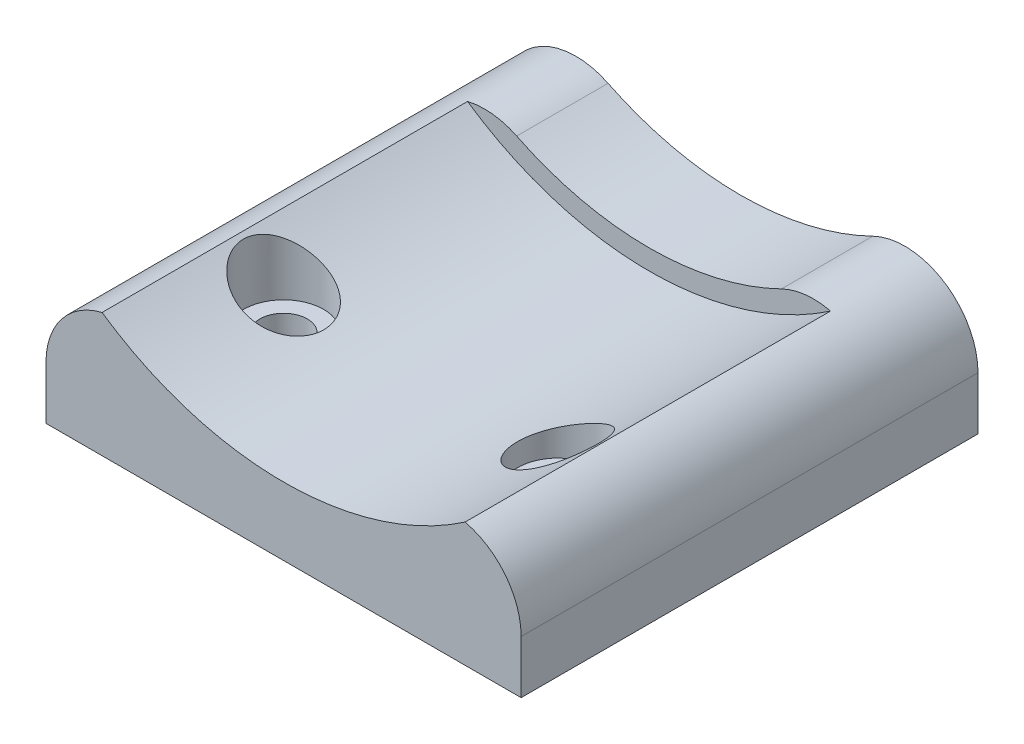
ISO-10303-21;
HEADER;
FILE_DESCRIPTION(('STEP AP214'),'2;1');
FILE_NAME('part.step','',(''),(''),'','','');
FILE_SCHEMA(('AUTOMOTIVE_DESIGN { 1 0 10303 214 1 1 1 1 }'));
ENDSEC;
DATA;
#1=APPLICATION_CONTEXT('core data for automotive mechanical design processes');
#2=APPLICATION_PROTOCOL_DEFINITION('international standard','automotive_design',2000,#1);
#3=PRODUCT_CONTEXT('',#1,'mechanical');
#4=PRODUCT('Part','Part','',(#3));
#5=PRODUCT_RELATED_PRODUCT_CATEGORY('part','',(#4));
#6=PRODUCT_DEFINITION_FORMATION('','',#4);
#7=PRODUCT_DEFINITION_CONTEXT('part definition',#1,'design');
#8=PRODUCT_DEFINITION('design','',#6,#7);
#9=PRODUCT_DEFINITION_SHAPE('','',#8);
#10=(LENGTH_UNIT() NAMED_UNIT(*) SI_UNIT(.MILLI.,.METRE.));
#11=(NAMED_UNIT(*) PLANE_ANGLE_UNIT() SI_UNIT($,.RADIAN.));
#12=(NAMED_UNIT(*) SI_UNIT($,.STERADIAN.) SOLID_ANGLE_UNIT());
#13=UNCERTAINTY_MEASURE_WITH_UNIT(LENGTH_MEASURE(1.E-05),#10,'distance_accuracy_value','');
#14=(GEOMETRIC_REPRESENTATION_CONTEXT(3) GLOBAL_UNCERTAINTY_ASSIGNED_CONTEXT((#13)) GLOBAL_UNIT_ASSIGNED_CONTEXT((#10,
#11,#12)) REPRESENTATION_CONTEXT('',''));
#15=CARTESIAN_POINT('',(0.,0.,0.));
#16=DIRECTION('',(0.,0.,1.));
#17=DIRECTION('',(1.,0.,0.));
#18=AXIS2_PLACEMENT_3D('',#15,#16,#17);
#19=CARTESIAN_POINT('',(0.,54.1496007592404,-63.5));
#20=DIRECTION('',(0.,0.,1.));
#21=DIRECTION('',(1.,0.,0.));
#22=AXIS2_PLACEMENT_3D('',#19,#20,#21);
#23=CYLINDRICAL_SURFACE('',#22,41.91);
#24=DIRECTION('',(0.,0.,1.));
#25=VECTOR('',#24,1.);
#26=CARTESIAN_POINT('',(-18.3995121951219,16.4945074652176,-63.5));
#27=LINE('',#26,#25);
#28=CARTESIAN_POINT('',(-18.3995121951219,16.4945074652176,-63.5));
#29=VERTEX_POINT('',#28);
#30=CARTESIAN_POINT('',(-18.3995121951219,16.4945074652176,-50.8));
#31=VERTEX_POINT('',#30);
#32=EDGE_CURVE('E114',#29,#31,#27,.T.);
#33=ORIENTED_EDGE('',*,*,#32,.T.);
#34=CARTESIAN_POINT('',(0.,54.1496007592404,-50.8));
#35=DIRECTION('',(0.,0.,1.));
#36=DIRECTION('',(1.,0.,0.));
#37=AXIS2_PLACEMENT_3D('',#34,#35,#36);
#38=CIRCLE('',#37,41.91);
#39=CARTESIAN_POINT('',(18.3995121951219,16.4945074652176,-50.8));
#40=VERTEX_POINT('',#39);
#41=EDGE_CURVE('E229',#31,#40,#38,.T.);
#42=ORIENTED_EDGE('',*,*,#41,.T.);
#43=DIRECTION('',(0.,0.,1.));
#44=VECTOR('',#43,1.);
#45=CARTESIAN_POINT('',(18.3995121951219,16.4945074652176,-63.5));
#46=LINE('',#45,#44);
#47=CARTESIAN_POINT('',(18.3995121951219,16.4945074652176,-63.5));
#48=VERTEX_POINT('',#47);
#49=EDGE_CURVE('E126',#48,#40,#46,.T.);
#50=ORIENTED_EDGE('',*,*,#49,.F.);
#51=CARTESIAN_POINT('',(0.,54.1496007592404,-63.5));
#52=DIRECTION('',(0.,0.,-1.));
#53=DIRECTION('',(1.,0.,0.));
#54=AXIS2_PLACEMENT_3D('',#51,#52,#53);
#55=CIRCLE('',#54,41.91);
#56=EDGE_CURVE('E132',#48,#29,#55,.T.);
#57=ORIENTED_EDGE('',*,*,#56,.T.);
#58=EDGE_LOOP('',(#33,#42,#50,#57));
#59=FACE_BOUND('',#58,.T.);
#60=ADVANCED_FACE('F43',(#59),#23,.F.);
#61=CARTESIAN_POINT('',(33.02,0.,-63.5));
#62=DIRECTION('',(0.,-1.,0.));
#63=DIRECTION('',(1.,0.,0.));
#64=AXIS2_PLACEMENT_3D('',#61,#62,#63);
#65=PLANE('',#64);
#66=CARTESIAN_POINT('',(-19.05,0.,-19.05));
#67=DIRECTION('',(0.,-1.,0.));
#68=DIRECTION('',(1.,0.,0.));
#69=AXIS2_PLACEMENT_3D('',#66,#67,#68);
#70=CIRCLE('',#69,3.30199999999999);
#71=CARTESIAN_POINT('',(-15.748,0.,-19.05));
#72=VERTEX_POINT('',#71);
#73=EDGE_CURVE('E238',#72,#72,#70,.T.);
#74=ORIENTED_EDGE('',*,*,#73,.F.);
#75=EDGE_LOOP('',(#74));
#76=FACE_BOUND('',#75,.T.);
#77=CARTESIAN_POINT('',(19.05,0.,-19.05));
#78=DIRECTION('',(0.,-1.,0.));
#79=DIRECTION('',(1.,0.,0.));
#80=AXIS2_PLACEMENT_3D('',#77,#78,#79);
#81=CIRCLE('',#80,3.302);
#82=CARTESIAN_POINT('',(22.352,0.,-19.05));
#83=VERTEX_POINT('',#82);
#84=EDGE_CURVE('E240',#83,#83,#81,.T.);
#85=ORIENTED_EDGE('',*,*,#84,.F.);
#86=EDGE_LOOP('',(#85));
#87=FACE_BOUND('',#86,.T.);
#88=DIRECTION('',(1.,0.,0.));
#89=VECTOR('',#88,1.);
#90=CARTESIAN_POINT('',(33.02,0.,0.));
#91=LINE('',#90,#89);
#92=CARTESIAN_POINT('',(-33.02,0.,0.));
#93=VERTEX_POINT('',#92);
#94=CARTESIAN_POINT('',(33.02,0.,0.));
#95=VERTEX_POINT('',#94);
#96=EDGE_CURVE('E144',#93,#95,#91,.T.);
#97=ORIENTED_EDGE('',*,*,#96,.F.);
#98=DIRECTION('',(0.,0.,1.));
#99=VECTOR('',#98,1.);
#100=CARTESIAN_POINT('',(-33.02,0.,-63.5));
#101=LINE('',#100,#99);
#102=CARTESIAN_POINT('',(-33.02,0.,-63.5));
#103=VERTEX_POINT('',#102);
#104=EDGE_CURVE('E57',#103,#93,#101,.T.);
#105=ORIENTED_EDGE('',*,*,#104,.F.);
#106=DIRECTION('',(1.,0.,0.));
#107=VECTOR('',#106,1.);
#108=CARTESIAN_POINT('',(33.02,0.,-63.5));
#109=LINE('',#108,#107);
#110=CARTESIAN_POINT('',(33.02,0.,-63.5));
#111=VERTEX_POINT('',#110);
#112=EDGE_CURVE('E158',#103,#111,#109,.T.);
#113=ORIENTED_EDGE('',*,*,#112,.T.);
#114=DIRECTION('',(0.,0.,1.));
#115=VECTOR('',#114,1.);
#116=CARTESIAN_POINT('',(33.02,0.,-63.5));
#117=LINE('',#116,#115);
#118=EDGE_CURVE('E100',#111,#95,#117,.T.);
#119=ORIENTED_EDGE('',*,*,#118,.T.);
#120=EDGE_LOOP('',(#97,#105,#113,#119));
#121=FACE_BOUND('',#120,.T.);
#122=ADVANCED_FACE('F45',(#76,#87,#121),#65,.T.);
#123=CARTESIAN_POINT('',(-33.02,0.,-63.5));
#124=DIRECTION('',(-1.,0.,0.));
#125=DIRECTION('',(0.,0.,1.));
#126=AXIS2_PLACEMENT_3D('',#123,#124,#125);
#127=PLANE('',#126);
#128=DIRECTION('',(0.,-1.,0.));
#129=VECTOR('',#128,1.);
#130=CARTESIAN_POINT('',(-33.02,0.,0.));
#131=LINE('',#130,#129);
#132=CARTESIAN_POINT('',(-33.02,7.366,0.));
#133=VERTEX_POINT('',#132);
#134=EDGE_CURVE('E155',#133,#93,#131,.T.);
#135=ORIENTED_EDGE('',*,*,#134,.F.);
#136=DIRECTION('',(0.,0.,1.));
#137=VECTOR('',#136,1.);
#138=CARTESIAN_POINT('',(-33.02,7.366,-63.5));
#139=LINE('',#138,#137);
#140=CARTESIAN_POINT('',(-33.02,7.366,-63.5));
#141=VERTEX_POINT('',#140);
#142=EDGE_CURVE('E125',#141,#133,#139,.T.);
#143=ORIENTED_EDGE('',*,*,#142,.F.);
#144=DIRECTION('',(0.,-1.,0.));
#145=VECTOR('',#144,1.);
#146=CARTESIAN_POINT('',(-33.02,0.,-63.5));
#147=LINE('',#146,#145);
#148=EDGE_CURVE('E134',#141,#103,#147,.T.);
#149=ORIENTED_EDGE('',*,*,#148,.T.);
#150=ORIENTED_EDGE('',*,*,#104,.T.);
#151=EDGE_LOOP('',(#135,#143,#149,#150));
#152=FACE_BOUND('',#151,.T.);
#153=ADVANCED_FACE('F211',(#152),#127,.T.);
#154=CARTESIAN_POINT('',(-22.86,7.366,-63.5));
#155=DIRECTION('',(0.,0.,1.));
#156=DIRECTION('',(1.,0.,0.));
#157=AXIS2_PLACEMENT_3D('',#154,#155,#156);
#158=CYLINDRICAL_SURFACE('',#157,10.16);
#159=DIRECTION('',(0.,0.,1.));
#160=VECTOR('',#159,1.);
#161=CARTESIAN_POINT('',(-25.2299659074032,17.2457197125094,-25.4));
#162=LINE('',#161,#160);
#163=CARTESIAN_POINT('',(-25.2299659074032,17.2457197125094,-50.8));
#164=VERTEX_POINT('',#163);
#165=CARTESIAN_POINT('',(-25.2299659074032,17.2457197125094,0.));
#166=VERTEX_POINT('',#165);
#167=EDGE_CURVE('E65',#164,#166,#162,.T.);
#168=ORIENTED_EDGE('',*,*,#167,.F.);
#169=CARTESIAN_POINT('',(-22.86,7.366,-50.8));
#170=DIRECTION('',(0.,0.,1.));
#171=DIRECTION('',(1.,0.,0.));
#172=AXIS2_PLACEMENT_3D('',#169,#170,#171);
#173=CIRCLE('',#172,10.16);
#174=EDGE_CURVE('E121',#164,#31,#173,.F.);
#175=ORIENTED_EDGE('',*,*,#174,.T.);
#176=ORIENTED_EDGE('',*,*,#32,.F.);
#177=CARTESIAN_POINT('',(-22.86,7.366,-63.5));
#178=DIRECTION('',(0.,0.,1.));
#179=DIRECTION('',(-1.,0.,0.));
#180=AXIS2_PLACEMENT_3D('',#177,#178,#179);
#181=CIRCLE('',#180,10.16);
#182=EDGE_CURVE('E118',#29,#141,#181,.T.);
#183=ORIENTED_EDGE('',*,*,#182,.T.);
#184=ORIENTED_EDGE('',*,*,#142,.T.);
#185=CARTESIAN_POINT('',(-22.86,7.366,0.));
#186=DIRECTION('',(0.,0.,1.));
#187=DIRECTION('',(-1.,0.,0.));
#188=AXIS2_PLACEMENT_3D('',#185,#186,#187);
#189=CIRCLE('',#188,10.16);
#190=EDGE_CURVE('E153',#166,#133,#189,.T.);
#191=ORIENTED_EDGE('',*,*,#190,.F.);
#192=EDGE_LOOP('',(#168,#175,#176,#183,#184,#191));
#193=FACE_BOUND('',#192,.T.);
#194=ADVANCED_FACE('F116',(#193),#158,.T.);
#195=CARTESIAN_POINT('',(22.86,7.366,-63.5));
#196=DIRECTION('',(0.,0.,1.));
#197=DIRECTION('',(1.,0.,0.));
#198=AXIS2_PLACEMENT_3D('',#195,#196,#197);
#199=CYLINDRICAL_SURFACE('',#198,10.16);
#200=DIRECTION('',(0.,0.,1.));
#201=VECTOR('',#200,1.);
#202=CARTESIAN_POINT('',(25.2299659074032,17.2457197125094,-25.4));
#203=LINE('',#202,#201);
#204=CARTESIAN_POINT('',(25.2299659074032,17.2457197125094,0.));
#205=VERTEX_POINT('',#204);
#206=CARTESIAN_POINT('',(25.2299659074032,17.2457197125094,-50.8));
#207=VERTEX_POINT('',#206);
#208=EDGE_CURVE('E232',#205,#207,#203,.F.);
#209=ORIENTED_EDGE('',*,*,#208,.F.);
#210=CARTESIAN_POINT('',(22.86,7.366,0.));
#211=DIRECTION('',(0.,0.,1.));
#212=DIRECTION('',(-1.,0.,0.));
#213=AXIS2_PLACEMENT_3D('',#210,#211,#212);
#214=CIRCLE('',#213,10.16);
#215=CARTESIAN_POINT('',(33.02,7.36600000000001,0.));
#216=VERTEX_POINT('',#215);
#217=EDGE_CURVE('E150',#216,#205,#214,.T.);
#218=ORIENTED_EDGE('',*,*,#217,.F.);
#219=DIRECTION('',(0.,0.,1.));
#220=VECTOR('',#219,1.);
#221=CARTESIAN_POINT('',(33.02,7.36600000000001,-63.5));
#222=LINE('',#221,#220);
#223=CARTESIAN_POINT('',(33.02,7.36600000000001,-63.5));
#224=VERTEX_POINT('',#223);
#225=EDGE_CURVE('E162',#224,#216,#222,.T.);
#226=ORIENTED_EDGE('',*,*,#225,.F.);
#227=CARTESIAN_POINT('',(22.86,7.366,-63.5));
#228=DIRECTION('',(0.,0.,1.));
#229=DIRECTION('',(-1.,0.,0.));
#230=AXIS2_PLACEMENT_3D('',#227,#228,#229);
#231=CIRCLE('',#230,10.16);
#232=EDGE_CURVE('E137',#224,#48,#231,.T.);
#233=ORIENTED_EDGE('',*,*,#232,.T.);
#234=ORIENTED_EDGE('',*,*,#49,.T.);
#235=CARTESIAN_POINT('',(22.86,7.366,-50.8));
#236=DIRECTION('',(0.,0.,1.));
#237=DIRECTION('',(1.,0.,0.));
#238=AXIS2_PLACEMENT_3D('',#235,#236,#237);
#239=CIRCLE('',#238,10.16);
#240=EDGE_CURVE('E11',#40,#207,#239,.F.);
#241=ORIENTED_EDGE('',*,*,#240,.T.);
#242=EDGE_LOOP('',(#209,#218,#226,#233,#234,#241));
#243=FACE_BOUND('',#242,.T.);
#244=ADVANCED_FACE('F216',(#243),#199,.T.);
#245=CARTESIAN_POINT('',(33.02,7.36600000000001,-63.5));
#246=DIRECTION('',(1.,0.,0.));
#247=DIRECTION('',(0.,0.,-1.));
#248=AXIS2_PLACEMENT_3D('',#245,#246,#247);
#249=PLANE('',#248);
#250=DIRECTION('',(0.,1.,0.));
#251=VECTOR('',#250,1.);
#252=CARTESIAN_POINT('',(33.02,7.36600000000001,0.));
#253=LINE('',#252,#251);
#254=EDGE_CURVE('E147',#95,#216,#253,.T.);
#255=ORIENTED_EDGE('',*,*,#254,.F.);
#256=ORIENTED_EDGE('',*,*,#118,.F.);
#257=DIRECTION('',(0.,1.,0.));
#258=VECTOR('',#257,1.);
#259=CARTESIAN_POINT('',(33.02,7.36600000000001,-63.5));
#260=LINE('',#259,#258);
#261=EDGE_CURVE('E139',#111,#224,#260,.T.);
#262=ORIENTED_EDGE('',*,*,#261,.T.);
#263=ORIENTED_EDGE('',*,*,#225,.T.);
#264=EDGE_LOOP('',(#255,#256,#262,#263));
#265=FACE_BOUND('',#264,.T.);
#266=ADVANCED_FACE('F218',(#265),#249,.T.);
#267=CARTESIAN_POINT('',(-22.86,7.366,-63.5));
#268=DIRECTION('',(0.,0.,-1.));
#269=DIRECTION('',(-1.,0.,0.));
#270=AXIS2_PLACEMENT_3D('',#267,#268,#269);
#271=PLANE('',#270);
#272=ORIENTED_EDGE('',*,*,#112,.F.);
#273=ORIENTED_EDGE('',*,*,#148,.F.);
#274=ORIENTED_EDGE('',*,*,#182,.F.);
#275=ORIENTED_EDGE('',*,*,#56,.F.);
#276=ORIENTED_EDGE('',*,*,#232,.F.);
#277=ORIENTED_EDGE('',*,*,#261,.F.);
#278=EDGE_LOOP('',(#272,#273,#274,#275,#276,#277));
#279=FACE_BOUND('',#278,.T.);
#280=ADVANCED_FACE('F130',(#279),#271,.T.);
#281=CARTESIAN_POINT('',(-22.86,7.366,0.));
#282=DIRECTION('',(0.,0.,-1.));
#283=DIRECTION('',(-1.,0.,0.));
#284=AXIS2_PLACEMENT_3D('',#281,#282,#283);
#285=PLANE('',#284);
#286=ORIENTED_EDGE('',*,*,#217,.T.);
#287=CARTESIAN_POINT('',(0.,54.1496007592404,0.));
#288=DIRECTION('',(0.,0.,1.));
#289=DIRECTION('',(1.,0.,0.));
#290=AXIS2_PLACEMENT_3D('',#287,#288,#289);
#291=CIRCLE('',#290,44.704);
#292=EDGE_CURVE('E236',#166,#205,#291,.T.);
#293=ORIENTED_EDGE('',*,*,#292,.F.);
#294=ORIENTED_EDGE('',*,*,#190,.T.);
#295=ORIENTED_EDGE('',*,*,#134,.T.);
#296=ORIENTED_EDGE('',*,*,#96,.T.);
#297=ORIENTED_EDGE('',*,*,#254,.T.);
#298=EDGE_LOOP('',(#286,#293,#294,#295,#296,#297));
#299=FACE_BOUND('',#298,.T.);
#300=ADVANCED_FACE('F203',(#299),#285,.F.);
#301=CARTESIAN_POINT('',(0.,54.1496007592404,-50.8));
#302=DIRECTION('',(0.,0.,1.));
#303=DIRECTION('',(1.,0.,0.));
#304=AXIS2_PLACEMENT_3D('',#301,#302,#303);
#305=CYLINDRICAL_SURFACE('',#304,44.704);
#306=CARTESIAN_POINT('',(-13.462,11.5207118222765,-19.05));
#307=CARTESIAN_POINT('',(-13.4619957816436,11.5207113435619,-18.8989620430979));
#308=CARTESIAN_POINT('',(-13.4681250003553,11.5226448448931,-18.7479704847189));
#309=CARTESIAN_POINT('',(-13.492577012506,11.5303778091951,-18.447034294672));
#310=CARTESIAN_POINT('',(-13.5109013272135,11.5361777544828,-18.2970897959772));
#311=CARTESIAN_POINT('',(-13.5595898277863,11.5516455764414,-17.9993274792662));
#312=CARTESIAN_POINT('',(-13.5899579653586,11.5613147226477,-17.8515103757839));
#313=CARTESIAN_POINT('',(-13.6624680158654,11.584520789897,-17.5590447170677));
#314=CARTESIAN_POINT('',(-13.7046142139717,11.5980591186923,-17.4143973357578));
#315=CARTESIAN_POINT('',(-13.8002320341066,11.6289736436027,-17.1295243458681));
#316=CARTESIAN_POINT('',(-13.853689359164,11.6463449960512,-16.9892934096863));
#317=CARTESIAN_POINT('',(-13.9715009064145,11.6849258033289,-16.7139736072402));
#318=CARTESIAN_POINT('',(-14.0358591242006,11.7061366656815,-16.5788866487576));
#319=CARTESIAN_POINT('',(-14.1748512700826,11.7523536161953,-16.3148741040204));
#320=CARTESIAN_POINT('',(-14.2494801730707,11.7773578489939,-16.1859455459656));
#321=CARTESIAN_POINT('',(-14.408412358976,11.8311378061954,-15.9349589900704));
#322=CARTESIAN_POINT('',(-14.4927192523848,11.859914938697,-15.8129035818183));
#323=CARTESIAN_POINT('',(-14.6714536572567,11.9215873447088,-15.5748706957031));
#324=CARTESIAN_POINT('',(-14.7660019251049,11.9545327525604,-15.458996909566));
#325=CARTESIAN_POINT('',(-14.9634870494975,12.0241614778924,-15.2357670254912));
#326=CARTESIAN_POINT('',(-15.0664269380868,12.0608461476453,-15.1284140341697));
#327=CARTESIAN_POINT('',(-15.2797775213694,12.1378301702667,-14.9228822988389));
#328=CARTESIAN_POINT('',(-15.3901862457012,12.1781285706994,-14.8247011513432));
#329=CARTESIAN_POINT('',(-15.6176471968556,12.2622348375136,-14.6379294847926));
#330=CARTESIAN_POINT('',(-15.7347019101986,12.3060440199699,-14.5493425918414));
#331=CARTESIAN_POINT('',(-15.9796091622663,12.3989414009168,-14.3786352486771));
#332=CARTESIAN_POINT('',(-16.107709076208,12.4481746421041,-14.2969479729082));
#333=CARTESIAN_POINT('',(-16.3690997918818,12.5500824052065,-14.1447552042675));
#334=CARTESIAN_POINT('',(-16.5023924830052,12.6027581845021,-14.0742538296175));
#335=CARTESIAN_POINT('',(-16.9084997300123,12.7656069630699,-13.8799299891113));
#336=CARTESIAN_POINT('',(-17.187722847687,12.8806689587846,-13.7731639748787));
#337=CARTESIAN_POINT('',(-17.7743709783326,13.1297550433511,-13.6003761178864));
#338=CARTESIAN_POINT('',(-18.0824222952293,13.2645366084693,-13.5376202445076));
#339=CARTESIAN_POINT('',(-18.700485096843,13.5435108633991,-13.4642608565616));
#340=CARTESIAN_POINT('',(-19.0104972538301,13.6877069587734,-13.4536763212761));
#341=CARTESIAN_POINT('',(-19.6501055020949,13.9941948806099,-13.4843647705426));
#342=CARTESIAN_POINT('',(-19.9792484066087,14.15700544356,-13.5299172517828));
#343=CARTESIAN_POINT('',(-20.6232349764956,14.4852515737815,-13.6778583210916));
#344=CARTESIAN_POINT('',(-20.9380725788656,14.6506882147089,-13.780270769413));
#345=CARTESIAN_POINT('',(-21.5633052382143,14.9883344827433,-14.0468906846983));
#346=CARTESIAN_POINT('',(-21.8724274090653,15.1603936387739,-14.2142836925141));
#347=CARTESIAN_POINT('',(-22.4579097450959,15.4946730601172,-14.6074689073881));
#348=CARTESIAN_POINT('',(-22.7342550516914,15.6568888470302,-14.8332874537727));
#349=CARTESIAN_POINT('',(-23.112903205297,15.8839177896248,-15.2095283243467));
#350=CARTESIAN_POINT('',(-23.2318093463167,15.9560367217635,-15.3392647786281));
#351=CARTESIAN_POINT('',(-23.458106138822,16.0946090328297,-15.6111668419335));
#352=CARTESIAN_POINT('',(-23.5655033662914,16.1610656426086,-15.7533252680528));
#353=CARTESIAN_POINT('',(-23.7672770281687,16.2869765961735,-16.0491559969551));
#354=CARTESIAN_POINT('',(-23.8616724834163,16.3464411498758,-16.2028109616193));
#355=CARTESIAN_POINT('',(-24.0361626790774,16.4571455903143,-16.5208145949266));
#356=CARTESIAN_POINT('',(-24.1162632511373,16.5083888300978,-16.6851588653245));
#357=CARTESIAN_POINT('',(-24.2408250223282,16.5885319035332,-16.9766362561084));
#358=CARTESIAN_POINT('',(-24.2890277334858,16.6196997175215,-17.1015631177687));
#359=CARTESIAN_POINT('',(-24.3766350986914,16.6765436919099,-17.355670773743));
#360=CARTESIAN_POINT('',(-24.4160415516792,16.7022209751438,-17.4848506920438));
#361=CARTESIAN_POINT('',(-24.4855582745332,16.7476385385342,-17.7466275279826));
#362=CARTESIAN_POINT('',(-24.5156741952223,16.7673824273965,-17.8792223151876));
#363=CARTESIAN_POINT('',(-24.5662444472409,16.8005958548915,-18.1470277167124));
#364=CARTESIAN_POINT('',(-24.5866984116205,16.8140651552225,-18.2822384301789));
#365=CARTESIAN_POINT('',(-24.617696703115,16.8344969459893,-18.5546759498204));
#366=CARTESIAN_POINT('',(-24.6282125642497,16.8414407449371,-18.691907410733));
#367=CARTESIAN_POINT('',(-24.6390774399199,16.8486152238215,-18.9669463971807));
#368=CARTESIAN_POINT('',(-24.6394266241397,16.8488460158,-19.1047539130631));
#369=CARTESIAN_POINT('',(-24.6299527855846,16.8425897099663,-19.3798752612453));
#370=CARTESIAN_POINT('',(-24.6201289665544,16.8361020862942,-19.5171890540565));
#371=CARTESIAN_POINT('',(-24.590454830929,16.8165395227432,-19.7902477679019));
#372=CARTESIAN_POINT('',(-24.5706047039374,16.8034647074321,-19.9259927185542));
#373=CARTESIAN_POINT('',(-24.5222425982173,16.7716924232707,-20.1890309497484));
#374=CARTESIAN_POINT('',(-24.4941480222174,16.7532662658694,-20.3164340172666));
#375=CARTESIAN_POINT('',(-24.4293995131948,16.7109370195135,-20.5681296405345));
#376=CARTESIAN_POINT('',(-24.3927428213689,16.6870321653122,-20.6924211793954));
#377=CARTESIAN_POINT('',(-24.2705434499868,16.6076531748415,-21.059488081085));
#378=CARTESIAN_POINT('',(-24.1727338664841,16.5444896060846,-21.2966561967606));
#379=CARTESIAN_POINT('',(-23.940355159772,16.3960946049379,-21.7673508121489));
#380=CARTESIAN_POINT('',(-23.8036670180357,16.309613530867,-21.9994196819604));
#381=CARTESIAN_POINT('',(-23.5020467095155,16.121545224343,-22.4375993971478));
#382=CARTESIAN_POINT('',(-23.3371010952623,16.0199508026321,-22.6436978019982));
#383=CARTESIAN_POINT('',(-22.9575143142088,15.7900362680135,-23.0558226307174));
#384=CARTESIAN_POINT('',(-22.739133261802,15.6599804154348,-23.2574326350735));
#385=CARTESIAN_POINT('',(-22.2769459846884,15.3906413531689,-23.6215663939061));
#386=CARTESIAN_POINT('',(-22.0331247773453,15.2513527237733,-23.7840669269947));
#387=CARTESIAN_POINT('',(-21.4899467741712,14.9483333817355,-24.0880827461151));
#388=CARTESIAN_POINT('',(-21.1875825042282,14.7838977002648,-24.2235354598437));
#389=CARTESIAN_POINT('',(-20.5637269143928,14.4544498786648,-24.4391779918928));
#390=CARTESIAN_POINT('',(-20.2422272810356,14.2894375177342,-24.5193435972133));
#391=CARTESIAN_POINT('',(-19.7418436115095,14.0404362839763,-24.5977915002129));
#392=CARTESIAN_POINT('',(-19.5668210129919,13.9547579588282,-24.6168450537022));
#393=CARTESIAN_POINT('',(-19.2148594445623,13.7853241195432,-24.6383460149877));
#394=CARTESIAN_POINT('',(-19.0379212225347,13.7015678921972,-24.6407996849385));
#395=CARTESIAN_POINT('',(-18.6833655200289,13.5365764501548,-24.628781878442));
#396=CARTESIAN_POINT('',(-18.5057478054699,13.4553422127205,-24.6143039230479));
#397=CARTESIAN_POINT('',(-18.1514045296843,13.2960595396133,-24.5681672197437));
#398=CARTESIAN_POINT('',(-17.9746785743788,13.2180095642626,-24.5365168835977));
#399=CARTESIAN_POINT('',(-17.6296347556541,13.0682455429825,-24.4572686107213));
#400=CARTESIAN_POINT('',(-17.4612368594963,12.9964058829807,-24.4102570882483));
#401=CARTESIAN_POINT('',(-17.1282111852236,12.8566887051411,-24.3000681178878));
#402=CARTESIAN_POINT('',(-16.9635816851989,12.7888093548169,-24.2368982207243));
#403=CARTESIAN_POINT('',(-16.6396314995949,12.6574228279186,-24.0945183168624));
#404=CARTESIAN_POINT('',(-16.4803097519854,12.5939147739458,-24.0153115417117));
#405=CARTESIAN_POINT('',(-16.1686001402026,12.4716448270209,-23.8411526045861));
#406=CARTESIAN_POINT('',(-16.0162116516509,12.4128825063183,-23.7462018640337));
#407=CARTESIAN_POINT('',(-15.7324028742145,12.3051242903228,-23.5496179953101));
#408=CARTESIAN_POINT('',(-15.6002934211206,12.2557225975141,-23.4492007691425));
#409=CARTESIAN_POINT('',(-15.3446262707963,12.1614044993992,-23.2361240229683));
#410=CARTESIAN_POINT('',(-15.2210678114001,12.1164876941884,-23.1234655963487));
#411=CARTESIAN_POINT('',(-14.9838011402177,12.0313243183602,-22.8866470281755));
#412=CARTESIAN_POINT('',(-14.8700908259858,11.9910767502979,-22.7624893533263));
#413=CARTESIAN_POINT('',(-14.653719969141,11.9153818329325,-22.5035384670845));
#414=CARTESIAN_POINT('',(-14.5510586825644,11.8799341603965,-22.368745972826));
#415=CARTESIAN_POINT('',(-14.3651596019679,11.8164137326792,-22.1000286506326));
#416=CARTESIAN_POINT('',(-14.2810430639627,11.7879875318641,-21.9667943309226));
#417=CARTESIAN_POINT('',(-14.124062811389,11.7353894597116,-21.6930621341394));
#418=CARTESIAN_POINT('',(-14.0511982680604,11.7112172750285,-21.5525647930388));
#419=CARTESIAN_POINT('',(-13.9174943610176,11.6671817471854,-21.2654418815792));
#420=CARTESIAN_POINT('',(-13.8566454809023,11.6473149929005,-21.1188212732593));
#421=CARTESIAN_POINT('',(-13.7475248267338,11.6118944886898,-20.8205191731547));
#422=CARTESIAN_POINT('',(-13.6992509675627,11.5963400236973,-20.6688385251081));
#423=CARTESIAN_POINT('',(-13.5928902959223,11.5622123676818,-20.2773369019005));
#424=CARTESIAN_POINT('',(-13.5438949592146,11.5466469137737,-20.034714870955));
#425=CARTESIAN_POINT('',(-13.4784542794764,11.5258973566854,-19.5446869039003));
#426=CARTESIAN_POINT('',(-13.4620069063468,11.5207126060343,-19.2972812671288));
#427=CARTESIAN_POINT('',(-13.462,11.5207118222765,-19.05));
#428=B_SPLINE_CURVE_WITH_KNOTS('',3,(#306,#307,#308,#309,#310,#311,#312,#313,#314,#315,#316,
#317,#318,#319,#320,#321,#322,#323,#324,#325,#326,#327,#328,#329,#330,#331,#332,#333,#334,#335,
#336,#337,#338,#339,#340,#341,#342,#343,#344,#345,#346,#347,#348,#349,#350,#351,#352,#353,#354,
#355,#356,#357,#358,#359,#360,#361,#362,#363,#364,#365,#366,#367,#368,#369,#370,#371,#372,#373,
#374,#375,#376,#377,#378,#379,#380,#381,#382,#383,#384,#385,#386,#387,#388,#389,#390,#391,#392,
#393,#394,#395,#396,#397,#398,#399,#400,#401,#402,#403,#404,#405,#406,#407,#408,#409,#410,#411,
#412,#413,#414,#415,#416,#417,#418,#419,#420,#421,#422,#423,#424,#425,#426,#427),.UNSPECIFIED.,
.T.,.F.,(4,2,2,2,2,2,2,2,2,2,2,2,2,2,2,2,2,2,2,2,2,2,2,2,2,2,2,2,2,2,2,2,2,2,2,2,2,2,2,2,2,2,2,
2,2,2,2,2,2,2,2,2,2,2,2,2,2,2,2,2,4),(0.,0.452897290636673,0.905851088211217,1.35895362788734,
1.81222123342674,2.26491930679449,2.71778367178202,3.17042724770166,3.62324023996387,
4.08213695985333,4.54120022868267,5.00014286030022,5.45925834625395,5.93783176531639,
6.41658097003555,7.37340247781124,8.39531692745781,9.41760310940657,10.5228775124531,
11.6286160747688,12.7972926825462,13.9664970724347,14.5363809817727,15.1059375138356,
15.6746517609305,16.2431334660926,16.6551674331172,17.0671170569101,17.4788156224254,
17.8905298225191,18.3034197641534,18.716302814545,19.129218184317,19.5421257459058,
19.936950642233,20.3319029311924,21.121198035279,21.9666072975219,22.8124200055188,
23.7818997539632,24.7519537221432,25.8569324148416,26.962394726395,27.549181287331,
28.1357464760415,28.722536189475,29.3090387274517,29.8753538305952,30.4414047795655,
31.0073417784652,31.5732277103043,32.0919651249137,32.6106562438038,33.1292363547984,
33.6477815263901,34.1275062063357,34.6071955355335,35.0865034136172,35.5657317649534,
36.3072672315977,37.0487564453355),.UNSPECIFIED.);
#429=CARTESIAN_POINT('',(-13.462,11.5207118222765,-19.05));
#430=VERTEX_POINT('',#429);
#431=EDGE_CURVE('E47',#430,#430,#428,.T.);
#432=ORIENTED_EDGE('',*,*,#431,.T.);
#433=EDGE_LOOP('',(#432));
#434=FACE_BOUND('',#433,.T.);
#435=CARTESIAN_POINT('',(24.638,16.847904122224,-19.05));
#436=CARTESIAN_POINT('',(24.6380053151144,16.8479085430662,-18.9104980350667));
#437=CARTESIAN_POINT('',(24.6327727454256,16.8444501534863,-18.7710422459179));
#438=CARTESIAN_POINT('',(24.611934263322,16.8306983014306,-18.4932055877823));
#439=CARTESIAN_POINT('',(24.5963268348683,16.8204038400256,-18.3548248788833));
#440=CARTESIAN_POINT('',(24.5549560425064,16.7931775397544,-18.0802058198682));
#441=CARTESIAN_POINT('',(24.5291885255645,16.7762429867028,-17.9439683695406));
#442=CARTESIAN_POINT('',(24.4678548487416,16.7360599158958,-17.6746163683772));
#443=CARTESIAN_POINT('',(24.4322846913485,16.7128088223133,-17.5415031156712));
#444=CARTESIAN_POINT('',(24.3520060858355,16.6605397649972,-17.2799443000069));
#445=CARTESIAN_POINT('',(24.3073418229059,16.6315497031816,-17.151479577597));
#446=CARTESIAN_POINT('',(24.2093025504287,16.5682131838801,-16.8992617225977));
#447=CARTESIAN_POINT('',(24.1559242129921,16.5338646802385,-16.7755104124075));
#448=CARTESIAN_POINT('',(23.9835863168571,16.4235647145208,-16.4123594739078));
#449=CARTESIAN_POINT('',(23.8523577919489,16.3403153124743,-16.1808511029926));
#450=CARTESIAN_POINT('',(23.5513998704093,16.1520635221663,-15.7269398178417));
#451=CARTESIAN_POINT('',(23.3795613558777,16.0459178587122,-15.5064305937321));
#452=CARTESIAN_POINT('',(23.0089855064135,15.8210052425708,-15.0967055987191));
#453=CARTESIAN_POINT('',(22.8102362183112,15.7022326863627,-14.9075038173466));
#454=CARTESIAN_POINT('',(22.3576682508688,15.437055317633,-14.535158555886));
#455=CARTESIAN_POINT('',(22.1000968734637,15.2892321689375,-14.3575773161476));
#456=CARTESIAN_POINT('',(21.5616333536951,14.9878969733701,-14.0486033611622));
#457=CARTESIAN_POINT('',(21.2807272036776,14.8343815405296,-13.91723864059));
#458=CARTESIAN_POINT('',(20.6694294953298,14.5092881608821,-13.6908415120554));
#459=CARTESIAN_POINT('',(20.3369942016225,14.3375817605041,-13.6013988496639));
#460=CARTESIAN_POINT('',(19.8289668348509,14.0834559352318,-13.5138816663135));
#461=CARTESIAN_POINT('',(19.6579473517408,13.9992658275569,-13.4924850369174));
#462=CARTESIAN_POINT('',(19.3138511204142,13.8326169338842,-13.4655697353479));
#463=CARTESIAN_POINT('',(19.1407752547836,13.7501574443658,-13.4600444820718));
#464=CARTESIAN_POINT('',(18.7910917807147,13.5863122965042,-13.4652199587248));
#465=CARTESIAN_POINT('',(18.6144709317042,13.5049629344876,-13.4761728001479));
#466=CARTESIAN_POINT('',(18.261799036799,13.3452902959606,-13.5150261474926));
#467=CARTESIAN_POINT('',(18.085747786482,13.2669657889954,-13.5429196833496));
#468=CARTESIAN_POINT('',(17.7356532807205,13.1138758240938,-13.6158297970622));
#469=CARTESIAN_POINT('',(17.561609933883,13.0391102036805,-13.6608455923756));
#470=CARTESIAN_POINT('',(17.2171439279199,12.8936616008606,-13.7680579273762));
#471=CARTESIAN_POINT('',(17.0467209787595,12.8229782906289,-13.8302530851694));
#472=CARTESIAN_POINT('',(16.7220582351498,12.6905955526772,-13.9671433332615));
#473=CARTESIAN_POINT('',(16.5674843890378,12.6286107434953,-14.0407707520409));
#474=CARTESIAN_POINT('',(16.2644789462008,12.5089851654463,-14.202720449195));
#475=CARTESIAN_POINT('',(16.1160467638094,12.4513439819403,-14.2910413223564));
#476=CARTESIAN_POINT('',(15.8268815924371,12.3407333361553,-14.4819310272189));
#477=CARTESIAN_POINT('',(15.6861455766723,12.2877620321939,-14.58449420065));
#478=CARTESIAN_POINT('',(15.4138336239484,12.1867309707053,-14.8032911090761));
#479=CARTESIAN_POINT('',(15.2822569517688,12.1386708188147,-14.9195237448044));
#480=CARTESIAN_POINT('',(15.0404882111789,12.0515435598904,-15.1544245627841));
#481=CARTESIAN_POINT('',(14.9294290443261,12.0120593196773,-15.2720470462157));
#482=CARTESIAN_POINT('',(14.7173307189092,11.9375120896767,-15.5172959723292));
#483=CARTESIAN_POINT('',(14.6162906859157,11.9024487139815,-15.6449215402385));
#484=CARTESIAN_POINT('',(14.4252860533361,11.8368492757722,-15.9092443623085));
#485=CARTESIAN_POINT('',(14.3353183387031,11.8063119394219,-16.0459390482622));
#486=CARTESIAN_POINT('',(14.1673709547252,11.7498239804864,-16.3274037067279));
#487=CARTESIAN_POINT('',(14.0893908012226,11.7238731726524,-16.4721733527836));
#488=CARTESIAN_POINT('',(13.9506947005164,11.6780722614631,-16.7594388226266));
#489=CARTESIAN_POINT('',(13.8892079138072,11.6579435879403,-16.9015186859948));
#490=CARTESIAN_POINT('',(13.7780797538892,11.6217798262929,-17.1908025104386));
#491=CARTESIAN_POINT('',(13.7284423449013,11.6057461080145,-17.3380081675333));
#492=CARTESIAN_POINT('',(13.641544922569,11.5778031412709,-17.6363234614143));
#493=CARTESIAN_POINT('',(13.6042782269839,11.5658916659611,-17.7874309428663));
#494=CARTESIAN_POINT('',(13.5424360229257,11.5461842440066,-18.0925448953022));
#495=CARTESIAN_POINT('',(13.5178651232469,11.5383897918898,-18.2465523980464));
#496=CARTESIAN_POINT('',(13.4822467002112,11.5271069733482,-18.5513406302319));
#497=CARTESIAN_POINT('',(13.4707967393523,11.5234904343368,-18.7020697385806));
#498=CARTESIAN_POINT('',(13.4601459316011,11.5201259834713,-19.0040592384232));
#499=CARTESIAN_POINT('',(13.4609495031503,11.5203794670898,-19.1553198018954));
#500=CARTESIAN_POINT('',(13.4748063631393,11.524757514229,-19.4571535409445));
#501=CARTESIAN_POINT('',(13.4878541396299,11.5288803358976,-19.6077269951894));
#502=CARTESIAN_POINT('',(13.5260786719957,11.5409958417593,-19.9072254060404));
#503=CARTESIAN_POINT('',(13.5512598992066,11.5489899525788,-20.0561497342089));
#504=CARTESIAN_POINT('',(13.6132657756436,11.5687640026575,-20.3500113213633));
#505=CARTESIAN_POINT('',(13.6499929507596,11.5805122615541,-20.4949712996077));
#506=CARTESIAN_POINT('',(13.7348374079986,11.6078113961965,-20.7812080974861));
#507=CARTESIAN_POINT('',(13.7829588207323,11.6233636510251,-20.9224835607517));
#508=CARTESIAN_POINT('',(13.8901354360725,11.6582495787526,-21.2002782550167));
#509=CARTESIAN_POINT('',(13.9491864784497,11.6775818130062,-21.3367992723232));
#510=CARTESIAN_POINT('',(14.0777341990828,11.7200167680882,-21.6042800463063));
#511=CARTESIAN_POINT('',(14.1472347613768,11.7431208911854,-21.7352377117992));
#512=CARTESIAN_POINT('',(14.2968999719583,11.7933431547125,-21.9921279620456));
#513=CARTESIAN_POINT('',(14.3771749585551,11.8205032075708,-22.1179881714372));
#514=CARTESIAN_POINT('',(14.5470713941356,11.8785893456013,-22.3623347852006));
#515=CARTESIAN_POINT('',(14.6366962372879,11.9095167990967,-22.4808184866674));
#516=CARTESIAN_POINT('',(14.9184232962551,12.0078433923205,-22.8240180628654));
#517=CARTESIAN_POINT('',(15.1235195134478,12.0808335351971,-23.0367234376287));
#518=CARTESIAN_POINT('',(15.5686233778094,12.2434736197601,-23.4314743112957));
#519=CARTESIAN_POINT('',(15.8095699152878,12.3335994883719,-23.6122549996493));
#520=CARTESIAN_POINT('',(16.3132528732696,12.5275128853928,-23.9310669048278));
#521=CARTESIAN_POINT('',(16.5759942949418,12.6313035526245,-24.069088275282));
#522=CARTESIAN_POINT('',(17.1315847199551,12.8573318339101,-24.3075802709995));
#523=CARTESIAN_POINT('',(17.4252953303044,12.9802974319084,-24.4053470303205));
#524=CARTESIAN_POINT('',(18.0201873339265,13.2371873478086,-24.5508269633106));
#525=CARTESIAN_POINT('',(18.321371277266,13.3711154432118,-24.5985228044059));
#526=CARTESIAN_POINT('',(18.9476121985888,13.6580792899501,-24.6465639316055));
#527=CARTESIAN_POINT('',(19.2726709522379,13.8117883069705,-24.6428604503649));
#528=CARTESIAN_POINT('',(19.9146553052434,14.124835322827,-24.580120160627));
#529=CARTESIAN_POINT('',(20.2315778562093,14.2841753798017,-24.5210629148376));
#530=CARTESIAN_POINT('',(20.8723250689572,14.615654286846,-24.3436982777065));
#531=CARTESIAN_POINT('',(21.1950068759232,14.7878894478437,-24.2214351188206));
#532=CARTESIAN_POINT('',(21.8147938584852,15.127975163586,-23.9183274605531));
#533=CARTESIAN_POINT('',(22.1118822670998,15.2958227945321,-23.7374449218363));
#534=CARTESIAN_POINT('',(22.5329302117921,15.5394768382392,-23.4233471286824));
#535=CARTESIAN_POINT('',(22.6699489280717,15.6198114563799,-23.3106893031772));
#536=CARTESIAN_POINT('',(22.933881219969,15.7763267946402,-23.0715512843874));
#537=CARTESIAN_POINT('',(23.0607999883455,15.8525096429054,-22.9450782744088));
#538=CARTESIAN_POINT('',(23.3031254253524,15.9994755482601,-22.6789175234962));
#539=CARTESIAN_POINT('',(23.4185424113918,16.0702634311213,-22.5392418489439));
#540=CARTESIAN_POINT('',(23.6365476352678,16.2051986061383,-22.2472623405378));
#541=CARTESIAN_POINT('',(23.739140570518,16.2693483283424,-22.0949631648347));
#542=CARTESIAN_POINT('',(23.9055590451469,16.3742262567631,-21.8191498694885));
#543=CARTESIAN_POINT('',(23.9725883673737,16.4167482137802,-21.6982376202006));
#544=CARTESIAN_POINT('',(24.0980555117168,16.496753990753,-21.4504490050136));
#545=CARTESIAN_POINT('',(24.1564952094134,16.534238910413,-21.3235739491272));
#546=CARTESIAN_POINT('',(24.2640778016961,16.6035458221772,-21.0646364902856));
#547=CARTESIAN_POINT('',(24.3132326333279,16.6353750822867,-20.9325810151183));
#548=CARTESIAN_POINT('',(24.4017203397797,16.6928732554146,-20.6639528935393));
#549=CARTESIAN_POINT('',(24.4410547196048,16.7185431123511,-20.5273809429245));
#550=CARTESIAN_POINT('',(24.5287559424297,16.7759212508054,-20.1719801036925));
#551=CARTESIAN_POINT('',(24.5695909922058,16.802795794256,-19.950433487783));
#552=CARTESIAN_POINT('',(24.6242094877713,16.8387841552153,-19.5025509568235));
#553=CARTESIAN_POINT('',(24.6379913810722,16.8478969534376,-19.2762147676694));
#554=CARTESIAN_POINT('',(24.638,16.847904122224,-19.05));
#555=B_SPLINE_CURVE_WITH_KNOTS('',3,(#435,#436,#437,#438,#439,#440,#441,#442,#443,#444,#445,
#446,#447,#448,#449,#450,#451,#452,#453,#454,#455,#456,#457,#458,#459,#460,#461,#462,#463,#464,
#465,#466,#467,#468,#469,#470,#471,#472,#473,#474,#475,#476,#477,#478,#479,#480,#481,#482,#483,
#484,#485,#486,#487,#488,#489,#490,#491,#492,#493,#494,#495,#496,#497,#498,#499,#500,#501,#502,
#503,#504,#505,#506,#507,#508,#509,#510,#511,#512,#513,#514,#515,#516,#517,#518,#519,#520,#521,
#522,#523,#524,#525,#526,#527,#528,#529,#530,#531,#532,#533,#534,#535,#536,#537,#538,#539,#540,
#541,#542,#543,#544,#545,#546,#547,#548,#549,#550,#551,#552,#553,#554),.UNSPECIFIED.,.T.,.F.,(4,
2,2,2,2,2,2,2,2,2,2,2,2,2,2,2,2,2,2,2,2,2,2,2,2,2,2,2,2,2,2,2,2,2,2,2,2,2,2,2,2,2,2,2,2,2,2,2,2,
2,2,2,2,2,2,2,2,2,2,4),(0.,0.418286292328429,0.836633720697938,1.25515233016897,
1.67384186452918,2.09054369471212,2.50740503644319,3.34045730241874,4.23423075784408,
5.12840251800324,6.16223986434634,7.19670236186807,8.34501405451491,8.9199204254698,
9.49458837573665,10.0781384913219,10.6614486740571,11.244732200849,11.8279688224416,
12.3735105939026,12.9190002222626,13.4642737518405,14.0095034617262,14.5084157593951,
15.00728447562,15.506012519476,16.0047204152354,16.4724943370222,16.9404245343987,
17.4081015588497,17.8759482391134,18.3290252550699,18.7822656477237,19.2353021038878,
19.6885056377571,20.1379814433223,20.587620441883,21.0370886415489,21.4867243213772,
21.9413771014912,22.396195507009,23.3049923925004,24.2442136571803,25.1836510398683,
26.1786533694514,27.1740000160707,28.2481676850374,29.3227321062386,30.4745785628613,
31.6271739783517,32.2107109141863,32.7939458671404,33.3766528421183,33.9591457437783,
34.3926417242894,34.8260429080765,35.2588830415504,35.6916568005728,36.36990607748,
37.0481942756688),.UNSPECIFIED.);
#556=CARTESIAN_POINT('',(24.638,16.847904122224,-19.05));
#557=VERTEX_POINT('',#556);
#558=EDGE_CURVE('E171',#557,#557,#555,.T.);
#559=ORIENTED_EDGE('',*,*,#558,.T.);
#560=EDGE_LOOP('',(#559));
#561=FACE_BOUND('',#560,.T.);
#562=ORIENTED_EDGE('',*,*,#167,.T.);
#563=ORIENTED_EDGE('',*,*,#292,.T.);
#564=ORIENTED_EDGE('',*,*,#208,.T.);
#565=CARTESIAN_POINT('',(0.,54.1496007592404,-50.8));
#566=DIRECTION('',(0.,0.,1.));
#567=DIRECTION('',(1.,0.,0.));
#568=AXIS2_PLACEMENT_3D('',#565,#566,#567);
#569=CIRCLE('',#568,44.704);
#570=EDGE_CURVE('E235',#164,#207,#569,.T.);
#571=ORIENTED_EDGE('',*,*,#570,.F.);
#572=EDGE_LOOP('',(#562,#563,#564,#571));
#573=FACE_BOUND('',#572,.T.);
#574=ADVANCED_FACE('F177',(#434,#561,#573),#305,.F.);
#575=CARTESIAN_POINT('',(0.,54.1496007592404,-50.8));
#576=DIRECTION('',(0.,0.,1.));
#577=DIRECTION('',(1.,0.,0.));
#578=AXIS2_PLACEMENT_3D('',#575,#576,#577);
#579=PLANE('',#578);
#580=ORIENTED_EDGE('',*,*,#570,.T.);
#581=ORIENTED_EDGE('',*,*,#240,.F.);
#582=ORIENTED_EDGE('',*,*,#41,.F.);
#583=ORIENTED_EDGE('',*,*,#174,.F.);
#584=EDGE_LOOP('',(#580,#581,#582,#583));
#585=FACE_BOUND('',#584,.T.);
#586=ADVANCED_FACE('F196',(#585),#579,.T.);
#587=CARTESIAN_POINT('',(19.05,17.526,-19.05));
#588=DIRECTION('',(0.,-1.,0.));
#589=DIRECTION('',(1.,0.,0.));
#590=AXIS2_PLACEMENT_3D('',#587,#588,#589);
#591=CYLINDRICAL_SURFACE('',#590,3.302);
#592=CARTESIAN_POINT('',(19.05,8.38200000000001,-19.05));
#593=DIRECTION('',(0.,-1.,0.));
#594=DIRECTION('',(1.,0.,0.));
#595=AXIS2_PLACEMENT_3D('',#592,#593,#594);
#596=CIRCLE('',#595,3.302);
#597=CARTESIAN_POINT('',(22.352,8.38200000000001,-19.05));
#598=VERTEX_POINT('',#597);
#599=EDGE_CURVE('E168',#598,#598,#596,.F.);
#600=ORIENTED_EDGE('',*,*,#599,.T.);
#601=EDGE_LOOP('',(#600));
#602=FACE_BOUND('',#601,.T.);
#603=ORIENTED_EDGE('',*,*,#84,.T.);
#604=EDGE_LOOP('',(#603));
#605=FACE_BOUND('',#604,.T.);
#606=ADVANCED_FACE('F193',(#602,#605),#591,.F.);
#607=CARTESIAN_POINT('',(-19.05,17.526,-19.05));
#608=DIRECTION('',(0.,-1.,0.));
#609=DIRECTION('',(1.,0.,0.));
#610=AXIS2_PLACEMENT_3D('',#607,#608,#609);
#611=CYLINDRICAL_SURFACE('',#610,3.30199999999999);
#612=CARTESIAN_POINT('',(-19.05,8.382,-19.05));
#613=DIRECTION('',(0.,-1.,0.));
#614=DIRECTION('',(1.,0.,0.));
#615=AXIS2_PLACEMENT_3D('',#612,#613,#614);
#616=CIRCLE('',#615,3.30199999999999);
#617=CARTESIAN_POINT('',(-15.748,8.382,-19.05));
#618=VERTEX_POINT('',#617);
#619=EDGE_CURVE('E165',#618,#618,#616,.F.);
#620=ORIENTED_EDGE('',*,*,#619,.T.);
#621=EDGE_LOOP('',(#620));
#622=FACE_BOUND('',#621,.T.);
#623=ORIENTED_EDGE('',*,*,#73,.T.);
#624=EDGE_LOOP('',(#623));
#625=FACE_BOUND('',#624,.T.);
#626=ADVANCED_FACE('F189',(#622,#625),#611,.F.);
#627=CARTESIAN_POINT('',(-19.05,17.526,-19.05));
#628=DIRECTION('',(0.,-1.,0.));
#629=DIRECTION('',(1.,0.,0.));
#630=AXIS2_PLACEMENT_3D('',#627,#628,#629);
#631=CYLINDRICAL_SURFACE('',#630,5.588);
#632=CARTESIAN_POINT('',(-19.05,8.382,-19.05));
#633=DIRECTION('',(0.,-1.,0.));
#634=DIRECTION('',(1.,0.,0.));
#635=AXIS2_PLACEMENT_3D('',#632,#633,#634);
#636=CIRCLE('',#635,5.588);
#637=CARTESIAN_POINT('',(-13.462,8.38200000000001,-19.05));
#638=VERTEX_POINT('',#637);
#639=EDGE_CURVE('E169',#638,#638,#636,.T.);
#640=ORIENTED_EDGE('',*,*,#639,.T.);
#641=EDGE_LOOP('',(#640));
#642=FACE_BOUND('',#641,.T.);
#643=ORIENTED_EDGE('',*,*,#431,.F.);
#644=EDGE_LOOP('',(#643));
#645=FACE_BOUND('',#644,.T.);
#646=ADVANCED_FACE('F192',(#642,#645),#631,.F.);
#647=CARTESIAN_POINT('',(-19.05,8.382,-19.05));
#648=DIRECTION('',(0.,-1.,0.));
#649=DIRECTION('',(1.,0.,0.));
#650=AXIS2_PLACEMENT_3D('',#647,#648,#649);
#651=PLANE('',#650);
#652=ORIENTED_EDGE('',*,*,#639,.F.);
#653=EDGE_LOOP('',(#652));
#654=FACE_BOUND('',#653,.T.);
#655=ORIENTED_EDGE('',*,*,#619,.F.);
#656=EDGE_LOOP('',(#655));
#657=FACE_BOUND('',#656,.T.);
#658=ADVANCED_FACE('F187',(#654,#657),#651,.F.);
#659=CARTESIAN_POINT('',(19.05,17.526,-19.05));
#660=DIRECTION('',(0.,-1.,0.));
#661=DIRECTION('',(1.,0.,0.));
#662=AXIS2_PLACEMENT_3D('',#659,#660,#661);
#663=CYLINDRICAL_SURFACE('',#662,5.588);
#664=CARTESIAN_POINT('',(19.05,8.38200000000001,-19.05));
#665=DIRECTION('',(0.,-1.,0.));
#666=DIRECTION('',(1.,0.,0.));
#667=AXIS2_PLACEMENT_3D('',#664,#665,#666);
#668=CIRCLE('',#667,5.588);
#669=CARTESIAN_POINT('',(24.638,8.38200000000001,-19.05));
#670=VERTEX_POINT('',#669);
#671=EDGE_CURVE('E245',#670,#670,#668,.T.);
#672=ORIENTED_EDGE('',*,*,#671,.T.);
#673=EDGE_LOOP('',(#672));
#674=FACE_BOUND('',#673,.T.);
#675=ORIENTED_EDGE('',*,*,#558,.F.);
#676=EDGE_LOOP('',(#675));
#677=FACE_BOUND('',#676,.T.);
#678=ADVANCED_FACE('F181',(#674,#677),#663,.F.);
#679=CARTESIAN_POINT('',(19.05,8.38200000000001,-19.05));
#680=DIRECTION('',(0.,-1.,0.));
#681=DIRECTION('',(1.,0.,0.));
#682=AXIS2_PLACEMENT_3D('',#679,#680,#681);
#683=PLANE('',#682);
#684=ORIENTED_EDGE('',*,*,#671,.F.);
#685=EDGE_LOOP('',(#684));
#686=FACE_BOUND('',#685,.T.);
#687=ORIENTED_EDGE('',*,*,#599,.F.);
#688=EDGE_LOOP('',(#687));
#689=FACE_BOUND('',#688,.T.);
#690=ADVANCED_FACE('F186',(#686,#689),#683,.F.);
#691=CLOSED_SHELL('',(#60,#122,#153,#194,#244,#266,#280,#300,#574,#586,#606,#626,#646,#658,#678,#690));
#692=MANIFOLD_SOLID_BREP('B2',#691);
#693=ADVANCED_BREP_SHAPE_REPRESENTATION('',(#18,#692),#14);
#694=SHAPE_DEFINITION_REPRESENTATION(#9,#693);
ENDSEC;
END-ISO-10303-21;
